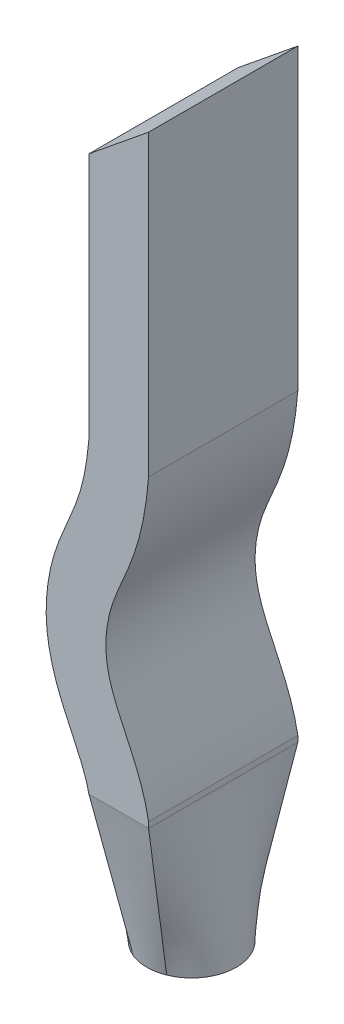
ISO-10303-21;
HEADER;
FILE_DESCRIPTION(('STEP AP214'),'2;1');
FILE_NAME('part.step','',(''),(''),'','','');
FILE_SCHEMA(('AUTOMOTIVE_DESIGN { 1 0 10303 214 1 1 1 1 }'));
ENDSEC;
DATA;
#1=APPLICATION_CONTEXT('core data for automotive mechanical design processes');
#2=APPLICATION_PROTOCOL_DEFINITION('international standard','automotive_design',2000,#1);
#3=PRODUCT_CONTEXT('',#1,'mechanical');
#4=PRODUCT('Part','Part','',(#3));
#5=PRODUCT_RELATED_PRODUCT_CATEGORY('part','',(#4));
#6=PRODUCT_DEFINITION_FORMATION('','',#4);
#7=PRODUCT_DEFINITION_CONTEXT('part definition',#1,'design');
#8=PRODUCT_DEFINITION('design','',#6,#7);
#9=PRODUCT_DEFINITION_SHAPE('','',#8);
#10=(LENGTH_UNIT() NAMED_UNIT(*) SI_UNIT(.MILLI.,.METRE.));
#11=(NAMED_UNIT(*) PLANE_ANGLE_UNIT() SI_UNIT($,.RADIAN.));
#12=(NAMED_UNIT(*) SI_UNIT($,.STERADIAN.) SOLID_ANGLE_UNIT());
#13=UNCERTAINTY_MEASURE_WITH_UNIT(LENGTH_MEASURE(1.E-05),#10,'distance_accuracy_value','');
#14=(GEOMETRIC_REPRESENTATION_CONTEXT(3) GLOBAL_UNCERTAINTY_ASSIGNED_CONTEXT((#13)) GLOBAL_UNIT_ASSIGNED_CONTEXT((#10,
#11,#12)) REPRESENTATION_CONTEXT('',''));
#15=CARTESIAN_POINT('',(0.,0.,0.));
#16=DIRECTION('',(0.,0.,1.));
#17=DIRECTION('',(1.,0.,0.));
#18=AXIS2_PLACEMENT_3D('',#15,#16,#17);
#19=CARTESIAN_POINT('',(0.,6.12820512820513,1.));
#20=DIRECTION('',(0.631088134778539,-0.775711135759791,0.));
#21=DIRECTION('',(0.775711135759791,0.631088134778539,0.));
#22=AXIS2_PLACEMENT_3D('',#19,#20,#21);
#23=PLANE('',#22);
#24=DIRECTION('',(-0.775711135759791,-0.631088134778539,0.));
#25=VECTOR('',#24,1.);
#26=CARTESIAN_POINT('',(0.,6.12820512820513,0.));
#27=LINE('',#26,#25);
#28=CARTESIAN_POINT('',(0.,6.12820512820513,0.));
#29=VERTEX_POINT('',#28);
#30=CARTESIAN_POINT('',(-0.4,5.8027808274902,0.));
#31=VERTEX_POINT('',#30);
#32=EDGE_CURVE('E210',#29,#31,#27,.T.);
#33=ORIENTED_EDGE('',*,*,#32,.T.);
#34=DIRECTION('',(0.,0.,-1.));
#35=VECTOR('',#34,1.);
#36=CARTESIAN_POINT('',(-0.4,5.8027808274902,1.));
#37=LINE('',#36,#35);
#38=CARTESIAN_POINT('',(-0.4,5.8027808274902,1.));
#39=VERTEX_POINT('',#38);
#40=EDGE_CURVE('E12',#39,#31,#37,.T.);
#41=ORIENTED_EDGE('',*,*,#40,.F.);
#42=DIRECTION('',(-0.775711135759791,-0.631088134778539,0.));
#43=VECTOR('',#42,1.);
#44=CARTESIAN_POINT('',(0.,6.12820512820513,1.));
#45=LINE('',#44,#43);
#46=CARTESIAN_POINT('',(0.,6.12820512820513,1.));
#47=VERTEX_POINT('',#46);
#48=EDGE_CURVE('E185',#47,#39,#45,.T.);
#49=ORIENTED_EDGE('',*,*,#48,.F.);
#50=DIRECTION('',(0.,0.,-1.));
#51=VECTOR('',#50,1.);
#52=CARTESIAN_POINT('',(0.,6.12820512820513,1.));
#53=LINE('',#52,#51);
#54=EDGE_CURVE('E81',#47,#29,#53,.T.);
#55=ORIENTED_EDGE('',*,*,#54,.T.);
#56=EDGE_LOOP('',(#33,#41,#49,#55));
#57=FACE_BOUND('',#56,.T.);
#58=ADVANCED_FACE('F63',(#57),#23,.F.);
#59=CARTESIAN_POINT('',(-0.4,5.8027808274902,1.));
#60=DIRECTION('',(1.,0.,0.));
#61=DIRECTION('',(0.,1.,0.));
#62=AXIS2_PLACEMENT_3D('',#59,#60,#61);
#63=PLANE('',#62);
#64=DIRECTION('',(0.,-1.,0.));
#65=VECTOR('',#64,1.);
#66=CARTESIAN_POINT('',(-0.4,5.8027808274902,0.));
#67=LINE('',#66,#65);
#68=CARTESIAN_POINT('',(-0.4,4.14464058712034,0.));
#69=VERTEX_POINT('',#68);
#70=EDGE_CURVE('E170',#31,#69,#67,.T.);
#71=ORIENTED_EDGE('',*,*,#70,.T.);
#72=DIRECTION('',(0.,0.,-1.));
#73=VECTOR('',#72,1.);
#74=CARTESIAN_POINT('',(-0.4,4.14464058712034,1.));
#75=LINE('',#74,#73);
#76=CARTESIAN_POINT('',(-0.4,4.14464058712034,1.));
#77=VERTEX_POINT('',#76);
#78=EDGE_CURVE('E72',#77,#69,#75,.T.);
#79=ORIENTED_EDGE('',*,*,#78,.F.);
#80=DIRECTION('',(0.,-1.,0.));
#81=VECTOR('',#80,1.);
#82=CARTESIAN_POINT('',(-0.4,5.8027808274902,1.));
#83=LINE('',#82,#81);
#84=EDGE_CURVE('E213',#39,#77,#83,.T.);
#85=ORIENTED_EDGE('',*,*,#84,.F.);
#86=ORIENTED_EDGE('',*,*,#40,.T.);
#87=EDGE_LOOP('',(#71,#79,#85,#86));
#88=FACE_BOUND('',#87,.T.);
#89=ADVANCED_FACE('F212',(#88),#63,.F.);
#90=CARTESIAN_POINT('',(-0.4,4.14464058712034,1.));
#91=CARTESIAN_POINT('',(-0.405401695562384,4.08156475767329,1.));
#92=CARTESIAN_POINT('',(-0.423885477386796,3.94397463622245,1.));
#93=CARTESIAN_POINT('',(-0.468874650411525,3.76786357388069,1.));
#94=CARTESIAN_POINT('',(-0.535002804920862,3.61193467632235,1.));
#95=CARTESIAN_POINT('',(-0.6612272898743,3.32431961737534,1.));
#96=CARTESIAN_POINT('',(-0.704269405555906,2.95525134146745,1.));
#97=CARTESIAN_POINT('',(-0.633590827142104,2.64322724087272,1.));
#98=CARTESIAN_POINT('',(-0.49427674193606,2.34098930500737,1.));
#99=CARTESIAN_POINT('',(-0.426412675044635,2.2067966487499,1.));
#100=CARTESIAN_POINT('',(-0.400000000000282,2.08851813482477,1.));
#101=B_SPLINE_CURVE_WITH_KNOTS('',3,(#90,#91,#92,#93,#94,#95,#96,#97,#98,#99,#100),
.UNSPECIFIED.,.F.,.F.,(4,1,1,1,1,1,1,1,4),(0.00418969346810839,0.0650161320604344,
0.12584257065276,0.247495447837413,0.369148325022065,0.490801202206717,0.612454079391369,
0.734106956576021,0.977412710945325),.UNSPECIFIED.);
#102=DIRECTION('',(0.,0.,-1.));
#103=VECTOR('',#102,1.);
#104=SURFACE_OF_LINEAR_EXTRUSION('',#101,#103);
#105=CARTESIAN_POINT('',(-0.4,4.14464058712034,0.));
#106=CARTESIAN_POINT('',(-0.405401695562384,4.08156475767329,0.));
#107=CARTESIAN_POINT('',(-0.423885477386796,3.94397463622245,0.));
#108=CARTESIAN_POINT('',(-0.468874650411525,3.76786357388069,0.));
#109=CARTESIAN_POINT('',(-0.535002804920862,3.61193467632235,0.));
#110=CARTESIAN_POINT('',(-0.6612272898743,3.32431961737534,0.));
#111=CARTESIAN_POINT('',(-0.704269405555906,2.95525134146745,0.));
#112=CARTESIAN_POINT('',(-0.633590827142104,2.64322724087272,0.));
#113=CARTESIAN_POINT('',(-0.49427674193606,2.34098930500737,0.));
#114=CARTESIAN_POINT('',(-0.426412675044635,2.2067966487499,0.));
#115=CARTESIAN_POINT('',(-0.400000000000282,2.08851813482477,0.));
#116=B_SPLINE_CURVE_WITH_KNOTS('',3,(#105,#106,#107,#108,#109,#110,#111,#112,#113,#114,#115),
.UNSPECIFIED.,.F.,.F.,(4,1,1,1,1,1,1,1,4),(0.00418969346810839,0.0650161320604344,
0.12584257065276,0.247495447837413,0.369148325022065,0.490801202206717,0.612454079391369,
0.734106956576021,0.977412710945325),.UNSPECIFIED.);
#117=CARTESIAN_POINT('',(-0.400000000000282,2.08851813482477,0.));
#118=VERTEX_POINT('',#117);
#119=EDGE_CURVE('E165',#69,#118,#116,.T.);
#120=ORIENTED_EDGE('',*,*,#119,.T.);
#121=DIRECTION('',(0.,0.,-1.));
#122=VECTOR('',#121,1.);
#123=CARTESIAN_POINT('',(-0.400000000000282,2.08851813482477,1.));
#124=LINE('',#123,#122);
#125=CARTESIAN_POINT('',(-0.400000000000282,2.08851813482477,1.));
#126=VERTEX_POINT('',#125);
#127=EDGE_CURVE('E128',#126,#118,#124,.T.);
#128=ORIENTED_EDGE('',*,*,#127,.F.);
#129=EDGE_CURVE('E153',#77,#126,#101,.T.);
#130=ORIENTED_EDGE('',*,*,#129,.F.);
#131=ORIENTED_EDGE('',*,*,#78,.T.);
#132=EDGE_LOOP('',(#120,#128,#130,#131));
#133=FACE_BOUND('',#132,.T.);
#134=ADVANCED_FACE('F203',(#133),#104,.F.);
#135=CARTESIAN_POINT('',(0.,2.12820512820513,1.));
#136=DIRECTION('',(1.,0.,0.));
#137=DIRECTION('',(0.,1.,0.));
#138=AXIS2_PLACEMENT_3D('',#135,#136,#137);
#139=PLANE('',#138);
#140=DIRECTION('',(0.,-1.,0.));
#141=VECTOR('',#140,1.);
#142=CARTESIAN_POINT('',(0.,2.12820512820513,0.));
#143=LINE('',#142,#141);
#144=CARTESIAN_POINT('',(0.,2.12820512820513,0.));
#145=VERTEX_POINT('',#144);
#146=CARTESIAN_POINT('',(0.,2.08851813482477,0.));
#147=VERTEX_POINT('',#146);
#148=EDGE_CURVE('E164',#145,#147,#143,.T.);
#149=ORIENTED_EDGE('',*,*,#148,.F.);
#150=DIRECTION('',(0.,0.,-1.));
#151=VECTOR('',#150,1.);
#152=CARTESIAN_POINT('',(0.,2.12820512820513,1.));
#153=LINE('',#152,#151);
#154=CARTESIAN_POINT('',(0.,2.12820512820513,1.));
#155=VERTEX_POINT('',#154);
#156=EDGE_CURVE('E129',#155,#145,#153,.T.);
#157=ORIENTED_EDGE('',*,*,#156,.F.);
#158=DIRECTION('',(0.,-1.,0.));
#159=VECTOR('',#158,1.);
#160=CARTESIAN_POINT('',(0.,2.12820512820513,1.));
#161=LINE('',#160,#159);
#162=CARTESIAN_POINT('',(0.,2.08851813482477,1.));
#163=VERTEX_POINT('',#162);
#164=EDGE_CURVE('E149',#155,#163,#161,.T.);
#165=ORIENTED_EDGE('',*,*,#164,.T.);
#166=DIRECTION('',(0.,0.,1.));
#167=VECTOR('',#166,1.);
#168=CARTESIAN_POINT('',(0.,2.08851813482477,1.));
#169=LINE('',#168,#167);
#170=EDGE_CURVE('E66',#163,#147,#169,.F.);
#171=ORIENTED_EDGE('',*,*,#170,.T.);
#172=EDGE_LOOP('',(#149,#157,#165,#171));
#173=FACE_BOUND('',#172,.T.);
#174=ADVANCED_FACE('F157',(#173),#139,.T.);
#175=CARTESIAN_POINT('',(0.,4.12820512820513,1.));
#176=CARTESIAN_POINT('',(-0.0399710525625141,3.62397245694043,1.));
#177=CARTESIAN_POINT('',(-0.23003206601481,3.41368752557702,1.));
#178=CARTESIAN_POINT('',(-0.344850729978014,2.74279150406645,1.));
#179=CARTESIAN_POINT('',(-0.0708601403915666,2.5180140203569,1.));
#180=CARTESIAN_POINT('',(0.,2.12820512820513,1.));
#181=B_SPLINE_CURVE_WITH_KNOTS('',3,(#175,#176,#177,#178,#179,#180),.UNSPECIFIED.,.F.,.F.,(4,1,
1,4),(0.,0.355332774703261,0.455332774703261,1.),.UNSPECIFIED.);
#182=DIRECTION('',(0.,0.,-1.));
#183=VECTOR('',#182,1.);
#184=SURFACE_OF_LINEAR_EXTRUSION('',#181,#183);
#185=CARTESIAN_POINT('',(0.,4.12820512820513,0.));
#186=CARTESIAN_POINT('',(-0.0399710525625141,3.62397245694043,0.));
#187=CARTESIAN_POINT('',(-0.23003206601481,3.41368752557702,0.));
#188=CARTESIAN_POINT('',(-0.344850729978014,2.74279150406645,0.));
#189=CARTESIAN_POINT('',(-0.0708601403915666,2.5180140203569,0.));
#190=CARTESIAN_POINT('',(0.,2.12820512820513,0.));
#191=B_SPLINE_CURVE_WITH_KNOTS('',3,(#185,#186,#187,#188,#189,#190),.UNSPECIFIED.,.F.,.F.,(4,1,
1,4),(0.,0.355332774703261,0.455332774703261,1.),.UNSPECIFIED.);
#192=CARTESIAN_POINT('',(0.,4.12820512820513,0.));
#193=VERTEX_POINT('',#192);
#194=EDGE_CURVE('E178',#193,#145,#191,.T.);
#195=ORIENTED_EDGE('',*,*,#194,.F.);
#196=DIRECTION('',(0.,0.,-1.));
#197=VECTOR('',#196,1.);
#198=CARTESIAN_POINT('',(0.,4.12820512820513,1.));
#199=LINE('',#198,#197);
#200=CARTESIAN_POINT('',(0.,4.12820512820513,1.));
#201=VERTEX_POINT('',#200);
#202=EDGE_CURVE('E196',#201,#193,#199,.T.);
#203=ORIENTED_EDGE('',*,*,#202,.F.);
#204=EDGE_CURVE('E158',#201,#155,#181,.T.);
#205=ORIENTED_EDGE('',*,*,#204,.T.);
#206=ORIENTED_EDGE('',*,*,#156,.T.);
#207=EDGE_LOOP('',(#195,#203,#205,#206));
#208=FACE_BOUND('',#207,.T.);
#209=ADVANCED_FACE('F232',(#208),#184,.T.);
#210=CARTESIAN_POINT('',(0.,6.12820512820513,1.));
#211=DIRECTION('',(1.,0.,0.));
#212=DIRECTION('',(0.,0.,-1.));
#213=AXIS2_PLACEMENT_3D('',#210,#211,#212);
#214=PLANE('',#213);
#215=DIRECTION('',(0.,-1.,0.));
#216=VECTOR('',#215,1.);
#217=CARTESIAN_POINT('',(0.,6.12820512820513,0.));
#218=LINE('',#217,#216);
#219=EDGE_CURVE('E181',#29,#193,#218,.T.);
#220=ORIENTED_EDGE('',*,*,#219,.F.);
#221=ORIENTED_EDGE('',*,*,#54,.F.);
#222=DIRECTION('',(0.,-1.,0.));
#223=VECTOR('',#222,1.);
#224=CARTESIAN_POINT('',(0.,6.12820512820513,1.));
#225=LINE('',#224,#223);
#226=EDGE_CURVE('E160',#47,#201,#225,.T.);
#227=ORIENTED_EDGE('',*,*,#226,.T.);
#228=ORIENTED_EDGE('',*,*,#202,.T.);
#229=EDGE_LOOP('',(#220,#221,#227,#228));
#230=FACE_BOUND('',#229,.T.);
#231=ADVANCED_FACE('F236',(#230),#214,.T.);
#232=CARTESIAN_POINT('',(-0.685315956540005,2.96475870401964,1.));
#233=DIRECTION('',(0.,0.,1.));
#234=DIRECTION('',(1.,0.,0.));
#235=AXIS2_PLACEMENT_3D('',#232,#233,#234);
#236=PLANE('',#235);
#237=ORIENTED_EDGE('',*,*,#48,.T.);
#238=ORIENTED_EDGE('',*,*,#84,.T.);
#239=ORIENTED_EDGE('',*,*,#129,.T.);
#240=DIRECTION('',(1.,0.,0.));
#241=VECTOR('',#240,1.);
#242=CARTESIAN_POINT('',(-0.685315956540005,2.08851813482477,1.));
#243=LINE('',#242,#241);
#244=EDGE_CURVE('E135',#126,#163,#243,.T.);
#245=ORIENTED_EDGE('',*,*,#244,.T.);
#246=ORIENTED_EDGE('',*,*,#164,.F.);
#247=ORIENTED_EDGE('',*,*,#204,.F.);
#248=ORIENTED_EDGE('',*,*,#226,.F.);
#249=EDGE_LOOP('',(#237,#238,#239,#245,#246,#247,#248));
#250=FACE_BOUND('',#249,.T.);
#251=ADVANCED_FACE('F147',(#250),#236,.T.);
#252=CARTESIAN_POINT('',(-0.685315956540005,2.96475870401964,0.));
#253=DIRECTION('',(0.,0.,1.));
#254=DIRECTION('',(1.,0.,0.));
#255=AXIS2_PLACEMENT_3D('',#252,#253,#254);
#256=PLANE('',#255);
#257=ORIENTED_EDGE('',*,*,#32,.F.);
#258=ORIENTED_EDGE('',*,*,#219,.T.);
#259=ORIENTED_EDGE('',*,*,#194,.T.);
#260=ORIENTED_EDGE('',*,*,#148,.T.);
#261=DIRECTION('',(1.,0.,0.));
#262=VECTOR('',#261,1.);
#263=CARTESIAN_POINT('',(-0.685315956540005,2.08851813482477,0.));
#264=LINE('',#263,#262);
#265=EDGE_CURVE('E169',#118,#147,#264,.T.);
#266=ORIENTED_EDGE('',*,*,#265,.F.);
#267=ORIENTED_EDGE('',*,*,#119,.F.);
#268=ORIENTED_EDGE('',*,*,#70,.F.);
#269=EDGE_LOOP('',(#257,#258,#259,#260,#266,#267,#268));
#270=FACE_BOUND('',#269,.T.);
#271=ADVANCED_FACE('F208',(#270),#256,.F.);
#272=CARTESIAN_POINT('',(-0.200000000000141,1.08851813482477,0.511542339869149));
#273=DIRECTION('',(0.,-1.,0.));
#274=DIRECTION('',(0.,0.,-1.));
#275=AXIS2_PLACEMENT_3D('',#272,#273,#274);
#276=PLANE('',#275);
#277=CARTESIAN_POINT('',(-0.200000000000141,1.08851813482477,0.511542339869149));
#278=DIRECTION('',(0.,-1.,0.));
#279=DIRECTION('',(0.,0.,-1.));
#280=AXIS2_PLACEMENT_3D('',#277,#278,#279);
#281=CIRCLE('',#280,0.3);
#282=CARTESIAN_POINT('',(-0.31141720290644,1.08851813482477,0.7900853471347));
#283=VERTEX_POINT('',#282);
#284=CARTESIAN_POINT('',(-0.31141720290644,1.08851813482477,0.232999332603598));
#285=VERTEX_POINT('',#284);
#286=EDGE_CURVE('E215',#283,#285,#281,.T.);
#287=ORIENTED_EDGE('',*,*,#286,.T.);
#288=CARTESIAN_POINT('',(-0.088582797093842,1.08851813482477,0.232999332603598));
#289=VERTEX_POINT('',#288);
#290=EDGE_CURVE('E217',#285,#289,#281,.T.);
#291=ORIENTED_EDGE('',*,*,#290,.T.);
#292=CARTESIAN_POINT('',(-0.0885827970938421,1.08851813482477,0.7900853471347));
#293=VERTEX_POINT('',#292);
#294=EDGE_CURVE('E425',#289,#293,#281,.T.);
#295=ORIENTED_EDGE('',*,*,#294,.T.);
#296=EDGE_CURVE('E138',#293,#283,#281,.T.);
#297=ORIENTED_EDGE('',*,*,#296,.T.);
#298=EDGE_LOOP('',(#287,#291,#295,#297));
#299=FACE_BOUND('',#298,.T.);
#300=ADVANCED_FACE('F294',(#299),#276,.T.);
#301=CARTESIAN_POINT('',(0.,2.08851813482477,1.));
#302=CARTESIAN_POINT('',(-0.0885827970938421,1.08851813482477,0.7900853471347));
#303=CARTESIAN_POINT('',(-0.0666666666667137,2.08851813482477,1.));
#304=CARTESIAN_POINT('',(-0.123065555714549,1.08851813482477,0.803878450582993));
#305=CARTESIAN_POINT('',(-0.133333333333427,2.08851813482477,1.));
#306=CARTESIAN_POINT('',(-0.161532777857345,1.08851813482477,0.810775002307139));
#307=CARTESIAN_POINT('',(-0.266666666666855,2.08851813482477,1.));
#308=CARTESIAN_POINT('',(-0.238467222142937,1.08851813482477,0.810775002307139));
#309=CARTESIAN_POINT('',(-0.333333333333568,2.08851813482477,1.));
#310=CARTESIAN_POINT('',(-0.276934444285732,1.08851813482477,0.803878450582993));
#311=CARTESIAN_POINT('',(-0.400000000000282,2.08851813482477,1.));
#312=CARTESIAN_POINT('',(-0.31141720290644,1.08851813482477,0.7900853471347));
#313=B_SPLINE_SURFACE_WITH_KNOTS('',3,1,((#301,#302),(#303,#304),(#305,#306),(#307,#308),(#309,
#310),(#311,#312)),.UNSPECIFIED.,.F.,.F.,.F.,(4,2,4),(2,2),(0.,0.5,1.),(0.,1.),.UNSPECIFIED.);
#314=DIRECTION('',(0.0863693947081786,-0.975013180230482,-0.204669553267174));
#315=VECTOR('',#314,1.);
#316=CARTESIAN_POINT('',(-0.355708601453361,1.58851813482477,0.89504267356735));
#317=LINE('',#316,#315);
#318=EDGE_CURVE('E140',#126,#283,#317,.T.);
#319=DIRECTION('',(0.0863693947081785,0.975013180230482,0.204669553267174));
#320=VECTOR('',#319,1.);
#321=CARTESIAN_POINT('',(-0.044291398546921,1.58851813482477,0.89504267356735));
#322=LINE('',#321,#320);
#323=EDGE_CURVE('E120',#293,#163,#322,.T.);
#324=ORIENTED_EDGE('',*,*,#244,.F.);
#325=ORIENTED_EDGE('',*,*,#318,.T.);
#326=ORIENTED_EDGE('',*,*,#296,.F.);
#327=ORIENTED_EDGE('',*,*,#323,.T.);
#328=EDGE_LOOP('',(#324,#325,#326,#327));
#329=FACE_BOUND('',#328,.T.);
#330=ADVANCED_FACE('F133',(#329),#313,.T.);
#331=CARTESIAN_POINT('',(-0.400000000000282,2.08851813482477,1.));
#332=CARTESIAN_POINT('',(-0.31141720290644,1.08851813482477,0.7900853471347));
#333=CARTESIAN_POINT('',(-0.400000000000282,2.08851813482477,0.916666666666666));
#334=CARTESIAN_POINT('',(-0.354520651182293,1.08851813482477,0.772843967824346));
#335=CARTESIAN_POINT('',(-0.400000000000282,2.08851813482477,0.833333333333333));
#336=CARTESIAN_POINT('',(-0.401416262683811,1.08851813482477,0.74202260365412));
#337=CARTESIAN_POINT('',(-0.400000000000282,2.08851813482477,0.666666666666666));
#338=CARTESIAN_POINT('',(-0.475209520040742,1.08851813482477,0.645517647097267));
#339=CARTESIAN_POINT('',(-0.400000000000282,2.08851813482477,0.583333333333333));
#340=CARTESIAN_POINT('',(-0.500000000000141,1.08851813482477,0.579245636011822));
#341=CARTESIAN_POINT('',(-0.400000000000282,2.08851813482477,0.416666666666666));
#342=CARTESIAN_POINT('',(-0.500000000000141,1.08851813482477,0.443839043726477));
#343=CARTESIAN_POINT('',(-0.400000000000282,2.08851813482477,0.333333333333333));
#344=CARTESIAN_POINT('',(-0.475209520040742,1.08851813482477,0.377567032641031));
#345=CARTESIAN_POINT('',(-0.400000000000282,2.08851813482477,0.166666666666666));
#346=CARTESIAN_POINT('',(-0.401416262683811,1.08851813482477,0.281062076084179));
#347=CARTESIAN_POINT('',(-0.400000000000282,2.08851813482477,0.0833333333333331));
#348=CARTESIAN_POINT('',(-0.354520651182294,1.08851813482477,0.250240711913952));
#349=CARTESIAN_POINT('',(-0.400000000000282,2.08851813482477,0.));
#350=CARTESIAN_POINT('',(-0.31141720290644,1.08851813482477,0.232999332603598));
#351=B_SPLINE_SURFACE_WITH_KNOTS('',3,1,((#331,#332),(#333,#334),(#335,#336),(#337,#338),(#339,
#340),(#341,#342),(#343,#344),(#345,#346),(#347,#348),(#349,#350)),.UNSPECIFIED.,.F.,.F.,.F.,(4,
2,2,2,4),(2,2),(0.,0.25,0.5,0.75,1.),(0.,1.),.UNSPECIFIED.);
#352=DIRECTION('',(0.0859526768359262,-0.97030890484154,0.226081327247407));
#353=VECTOR('',#352,1.);
#354=CARTESIAN_POINT('',(-0.355708601453361,1.58851813482477,0.116499666301799));
#355=LINE('',#354,#353);
#356=EDGE_CURVE('E141',#118,#285,#355,.T.);
#357=ORIENTED_EDGE('',*,*,#127,.T.);
#358=ORIENTED_EDGE('',*,*,#356,.T.);
#359=ORIENTED_EDGE('',*,*,#286,.F.);
#360=ORIENTED_EDGE('',*,*,#318,.F.);
#361=EDGE_LOOP('',(#357,#358,#359,#360));
#362=FACE_BOUND('',#361,.T.);
#363=ADVANCED_FACE('F311',(#362),#351,.T.);
#364=CARTESIAN_POINT('',(0.,2.08851813482477,0.));
#365=CARTESIAN_POINT('',(-0.0885827970938421,1.08851813482477,0.232999332603598));
#366=CARTESIAN_POINT('',(0.,2.08851813482477,0.0833333333333334));
#367=CARTESIAN_POINT('',(-0.0454793488179884,1.08851813482477,0.250240711913952));
#368=CARTESIAN_POINT('',(0.,2.08851813482477,0.166666666666667));
#369=CARTESIAN_POINT('',(0.00141626268352872,1.08851813482477,0.281062076084179));
#370=CARTESIAN_POINT('',(0.,2.08851813482477,0.333333333333333));
#371=CARTESIAN_POINT('',(0.0752095200404601,1.08851813482477,0.377567032641031));
#372=CARTESIAN_POINT('',(0.,2.08851813482477,0.416666666666667));
#373=CARTESIAN_POINT('',(0.0999999999998592,1.08851813482477,0.443839043726477));
#374=CARTESIAN_POINT('',(0.,2.08851813482477,0.583333333333333));
#375=CARTESIAN_POINT('',(0.0999999999998592,1.08851813482477,0.579245636011821));
#376=CARTESIAN_POINT('',(0.,2.08851813482477,0.666666666666667));
#377=CARTESIAN_POINT('',(0.0752095200404601,1.08851813482477,0.645517647097267));
#378=CARTESIAN_POINT('',(0.,2.08851813482477,0.833333333333333));
#379=CARTESIAN_POINT('',(0.0014162626835287,1.08851813482477,0.74202260365412));
#380=CARTESIAN_POINT('',(0.,2.08851813482477,0.916666666666667));
#381=CARTESIAN_POINT('',(-0.0454793488179884,1.08851813482477,0.772843967824346));
#382=CARTESIAN_POINT('',(0.,2.08851813482477,1.));
#383=CARTESIAN_POINT('',(-0.0885827970938421,1.08851813482477,0.7900853471347));
#384=B_SPLINE_SURFACE_WITH_KNOTS('',3,1,((#364,#365),(#366,#367),(#368,#369),(#370,#371),(#372,
#373),(#374,#375),(#376,#377),(#378,#379),(#380,#381),(#382,#383)),.UNSPECIFIED.,.F.,.F.,.F.,(4,
2,2,2,4),(2,2),(0.,0.25,0.5,0.75,1.),(0.,1.),.UNSPECIFIED.);
#385=DIRECTION('',(-0.0859526768359263,-0.97030890484154,0.226081327247407));
#386=VECTOR('',#385,1.);
#387=CARTESIAN_POINT('',(-0.044291398546921,1.58851813482477,0.116499666301799));
#388=LINE('',#387,#386);
#389=EDGE_CURVE('E122',#147,#289,#388,.T.);
#390=ORIENTED_EDGE('',*,*,#170,.F.);
#391=ORIENTED_EDGE('',*,*,#323,.F.);
#392=ORIENTED_EDGE('',*,*,#294,.F.);
#393=ORIENTED_EDGE('',*,*,#389,.F.);
#394=EDGE_LOOP('',(#390,#391,#392,#393));
#395=FACE_BOUND('',#394,.T.);
#396=ADVANCED_FACE('F117',(#395),#384,.T.);
#397=CARTESIAN_POINT('',(-0.400000000000282,2.08851813482477,0.));
#398=CARTESIAN_POINT('',(-0.31141720290644,1.08851813482477,0.232999332603598));
#399=CARTESIAN_POINT('',(-0.333333333333568,2.08851813482477,0.));
#400=CARTESIAN_POINT('',(-0.276934444285733,1.08851813482477,0.219206229155306));
#401=CARTESIAN_POINT('',(-0.266666666666855,2.08851813482477,0.));
#402=CARTESIAN_POINT('',(-0.238467222142937,1.08851813482477,0.212309677431159));
#403=CARTESIAN_POINT('',(-0.133333333333427,2.08851813482477,0.));
#404=CARTESIAN_POINT('',(-0.161532777857345,1.08851813482477,0.212309677431159));
#405=CARTESIAN_POINT('',(-0.0666666666667136,2.08851813482477,0.));
#406=CARTESIAN_POINT('',(-0.123065555714549,1.08851813482477,0.219206229155306));
#407=CARTESIAN_POINT('',(0.,2.08851813482477,0.));
#408=CARTESIAN_POINT('',(-0.088582797093842,1.08851813482477,0.232999332603598));
#409=B_SPLINE_SURFACE_WITH_KNOTS('',3,1,((#397,#398),(#399,#400),(#401,#402),(#403,#404),(#405,
#406),(#407,#408)),.UNSPECIFIED.,.F.,.F.,.F.,(4,2,4),(2,2),(0.,0.5,1.),(0.,1.),.UNSPECIFIED.);
#410=ORIENTED_EDGE('',*,*,#265,.T.);
#411=ORIENTED_EDGE('',*,*,#389,.T.);
#412=ORIENTED_EDGE('',*,*,#290,.F.);
#413=ORIENTED_EDGE('',*,*,#356,.F.);
#414=EDGE_LOOP('',(#410,#411,#412,#413));
#415=FACE_BOUND('',#414,.T.);
#416=ADVANCED_FACE('F329',(#415),#409,.T.);
#417=CLOSED_SHELL('',(#58,#89,#134,#174,#209,#231,#251,#271,#300,#330,#363,#396,#416));
#418=MANIFOLD_SOLID_BREP('B2',#417);
#419=ADVANCED_BREP_SHAPE_REPRESENTATION('',(#18,#418),#14);
#420=SHAPE_DEFINITION_REPRESENTATION(#9,#419);
ENDSEC;
END-ISO-10303-21;
